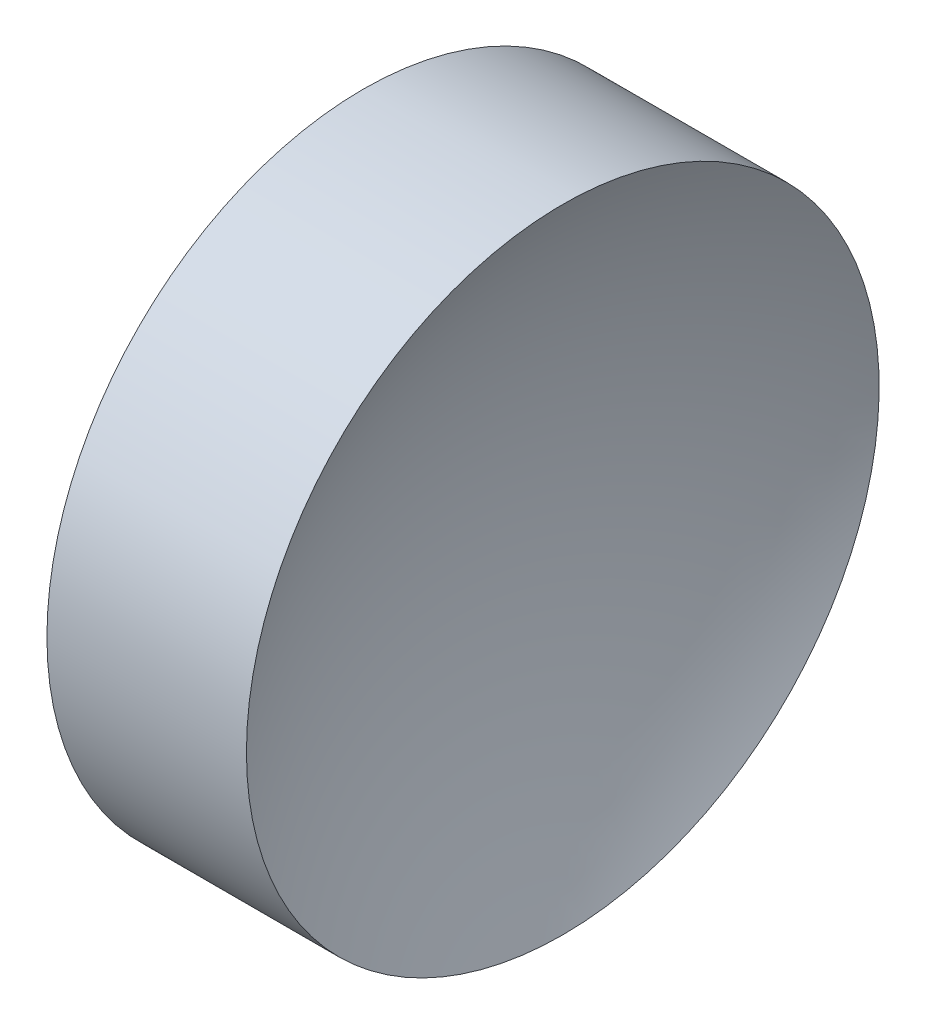
ISO-10303-21;
HEADER;
FILE_DESCRIPTION(('STEP AP214'),'2;1');
FILE_NAME('part.step','',(''),(''),'','','');
FILE_SCHEMA(('AUTOMOTIVE_DESIGN { 1 0 10303 214 1 1 1 1 }'));
ENDSEC;
DATA;
#1=APPLICATION_CONTEXT('core data for automotive mechanical design processes');
#2=APPLICATION_PROTOCOL_DEFINITION('international standard','automotive_design',2000,#1);
#3=PRODUCT_CONTEXT('',#1,'mechanical');
#4=PRODUCT('Part','Part','',(#3));
#5=PRODUCT_RELATED_PRODUCT_CATEGORY('part','',(#4));
#6=PRODUCT_DEFINITION_FORMATION('','',#4);
#7=PRODUCT_DEFINITION_CONTEXT('part definition',#1,'design');
#8=PRODUCT_DEFINITION('design','',#6,#7);
#9=PRODUCT_DEFINITION_SHAPE('','',#8);
#10=(LENGTH_UNIT() NAMED_UNIT(*) SI_UNIT(.MILLI.,.METRE.));
#11=(NAMED_UNIT(*) PLANE_ANGLE_UNIT() SI_UNIT($,.RADIAN.));
#12=(NAMED_UNIT(*) SI_UNIT($,.STERADIAN.) SOLID_ANGLE_UNIT());
#13=UNCERTAINTY_MEASURE_WITH_UNIT(LENGTH_MEASURE(1.E-05),#10,'distance_accuracy_value','');
#14=(GEOMETRIC_REPRESENTATION_CONTEXT(3) GLOBAL_UNCERTAINTY_ASSIGNED_CONTEXT((#13)) GLOBAL_UNIT_ASSIGNED_CONTEXT((#10,
#11,#12)) REPRESENTATION_CONTEXT('',''));
#15=CARTESIAN_POINT('',(0.,0.,0.));
#16=DIRECTION('',(0.,0.,1.));
#17=DIRECTION('',(1.,0.,0.));
#18=AXIS2_PLACEMENT_3D('',#15,#16,#17);
#19=CARTESIAN_POINT('',(173.724877167251,65.2226028729874,0.));
#20=DIRECTION('',(-1.,0.,0.));
#21=DIRECTION('',(0.,-1.,0.));
#22=AXIS2_PLACEMENT_3D('',#19,#20,#21);
#23=SPHERICAL_SURFACE('',#22,52.15);
#24=CARTESIAN_POINT('',(127.95783116251,65.2226028729874,0.));
#25=DIRECTION('',(-1.,0.,0.));
#26=DIRECTION('',(0.,0.,1.));
#27=AXIS2_PLACEMENT_3D('',#24,#25,#26);
#28=CIRCLE('',#27,25.);
#29=CARTESIAN_POINT('',(127.95783116251,65.2226028729874,25.));
#30=VERTEX_POINT('',#29);
#31=EDGE_CURVE('E10',#30,#30,#28,.T.);
#32=ORIENTED_EDGE('',*,*,#31,.F.);
#33=EDGE_LOOP('',(#32));
#34=FACE_BOUND('',#33,.T.);
#35=ADVANCED_FACE('F35',(#34),#23,.F.);
#36=CARTESIAN_POINT('',(106.124652785342,65.2226028729874,0.));
#37=DIRECTION('',(-1.,0.,0.));
#38=DIRECTION('',(0.,0.,1.));
#39=AXIS2_PLACEMENT_3D('',#36,#37,#38);
#40=CYLINDRICAL_SURFACE('',#39,25.);
#41=CARTESIAN_POINT('',(112.191923171991,65.2226028729874,0.));
#42=DIRECTION('',(-1.,0.,0.));
#43=DIRECTION('',(0.,0.,1.));
#44=AXIS2_PLACEMENT_3D('',#41,#42,#43);
#45=CIRCLE('',#44,25.);
#46=CARTESIAN_POINT('',(112.191923171991,65.2226028729874,25.));
#47=VERTEX_POINT('',#46);
#48=EDGE_CURVE('E41',#47,#47,#45,.T.);
#49=ORIENTED_EDGE('',*,*,#48,.F.);
#50=EDGE_LOOP('',(#49));
#51=FACE_BOUND('',#50,.T.);
#52=ORIENTED_EDGE('',*,*,#31,.T.);
#53=EDGE_LOOP('',(#52));
#54=FACE_BOUND('',#53,.T.);
#55=ADVANCED_FACE('F49',(#51,#54),#40,.T.);
#56=CARTESIAN_POINT('',(66.4248771672505,65.2226028729874,0.));
#57=DIRECTION('',(-1.,0.,0.));
#58=DIRECTION('',(0.,1.,0.));
#59=AXIS2_PLACEMENT_3D('',#56,#57,#58);
#60=SPHERICAL_SURFACE('',#59,52.15);
#61=ORIENTED_EDGE('',*,*,#48,.T.);
#62=EDGE_LOOP('',(#61));
#63=FACE_BOUND('',#62,.T.);
#64=ADVANCED_FACE('F47',(#63),#60,.F.);
#65=CLOSED_SHELL('',(#35,#55,#64));
#66=MANIFOLD_SOLID_BREP('B2',#65);
#67=ADVANCED_BREP_SHAPE_REPRESENTATION('',(#18,#66),#14);
#68=SHAPE_DEFINITION_REPRESENTATION(#9,#67);
ENDSEC;
END-ISO-10303-21;
